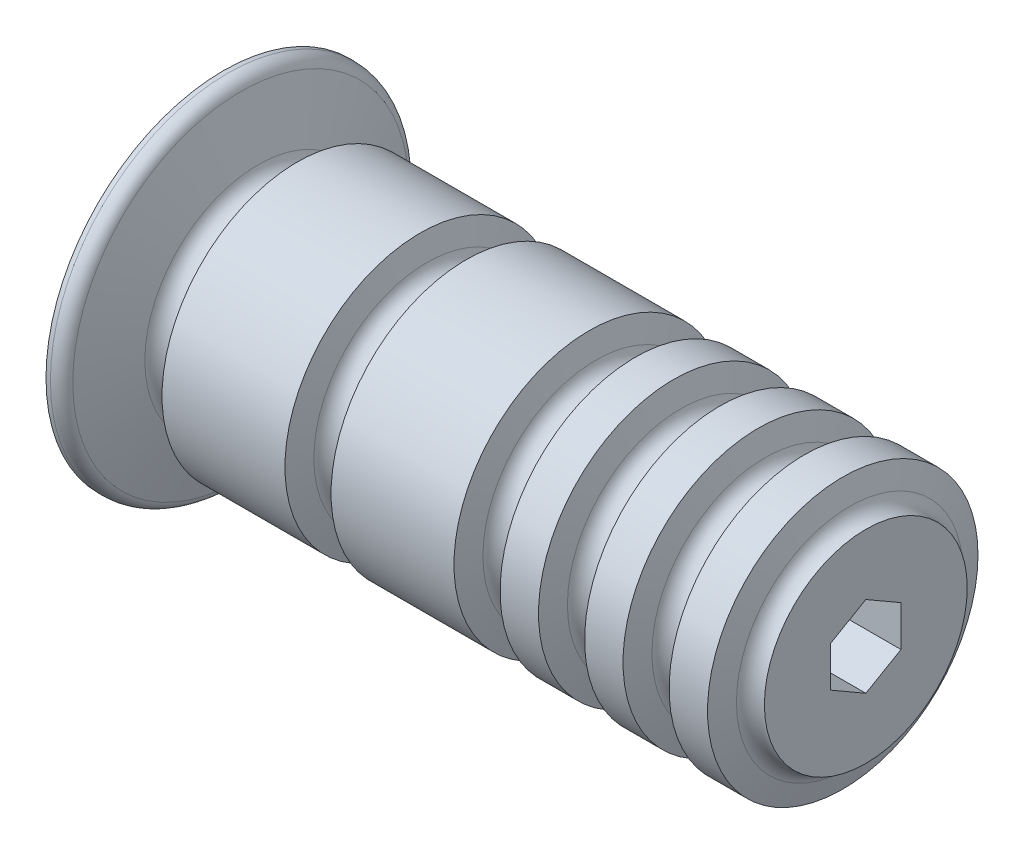
ISO-10303-21;
HEADER;
FILE_DESCRIPTION(('STEP AP214'),'2;1');
FILE_NAME('part.step','',(''),(''),'','','');
FILE_SCHEMA(('AUTOMOTIVE_DESIGN { 1 0 10303 214 1 1 1 1 }'));
ENDSEC;
DATA;
#1=APPLICATION_CONTEXT('core data for automotive mechanical design processes');
#2=APPLICATION_PROTOCOL_DEFINITION('international standard','automotive_design',2000,#1);
#3=PRODUCT_CONTEXT('',#1,'mechanical');
#4=PRODUCT('Part','Part','',(#3));
#5=PRODUCT_RELATED_PRODUCT_CATEGORY('part','',(#4));
#6=PRODUCT_DEFINITION_FORMATION('','',#4);
#7=PRODUCT_DEFINITION_CONTEXT('part definition',#1,'design');
#8=PRODUCT_DEFINITION('design','',#6,#7);
#9=PRODUCT_DEFINITION_SHAPE('','',#8);
#10=(LENGTH_UNIT() NAMED_UNIT(*) SI_UNIT(.MILLI.,.METRE.));
#11=(NAMED_UNIT(*) PLANE_ANGLE_UNIT() SI_UNIT($,.RADIAN.));
#12=(NAMED_UNIT(*) SI_UNIT($,.STERADIAN.) SOLID_ANGLE_UNIT());
#13=UNCERTAINTY_MEASURE_WITH_UNIT(LENGTH_MEASURE(1.E-05),#10,'distance_accuracy_value','');
#14=(GEOMETRIC_REPRESENTATION_CONTEXT(3) GLOBAL_UNCERTAINTY_ASSIGNED_CONTEXT((#13)) GLOBAL_UNIT_ASSIGNED_CONTEXT((#10,
#11,#12)) REPRESENTATION_CONTEXT('',''));
#15=CARTESIAN_POINT('',(0.,0.,0.));
#16=DIRECTION('',(0.,0.,1.));
#17=DIRECTION('',(1.,0.,0.));
#18=AXIS2_PLACEMENT_3D('',#15,#16,#17);
#19=CARTESIAN_POINT('',(0.,0.,0.));
#20=DIRECTION('',(1.,0.,0.));
#21=DIRECTION('',(0.,0.,-1.));
#22=AXIS2_PLACEMENT_3D('',#19,#20,#21);
#23=CYLINDRICAL_SURFACE('',#22,25.4);
#24=CARTESIAN_POINT('',(84.5698463729872,0.,0.));
#25=DIRECTION('',(1.,0.,0.));
#26=DIRECTION('',(0.,0.,-1.));
#27=AXIS2_PLACEMENT_3D('',#24,#25,#26);
#28=CIRCLE('',#27,25.3999999999998);
#29=CARTESIAN_POINT('',(84.5698463729872,0.,-25.3999999999998));
#30=VERTEX_POINT('',#29);
#31=EDGE_CURVE('E112',#30,#30,#28,.T.);
#32=ORIENTED_EDGE('',*,*,#31,.F.);
#33=EDGE_LOOP('',(#32));
#34=FACE_BOUND('',#33,.T.);
#35=CARTESIAN_POINT('',(77.3551536270128,0.,0.));
#36=DIRECTION('',(1.,0.,0.));
#37=DIRECTION('',(0.,0.,-1.));
#38=AXIS2_PLACEMENT_3D('',#35,#36,#37);
#39=CIRCLE('',#38,25.4);
#40=CARTESIAN_POINT('',(77.3551536270128,0.,-25.4));
#41=VERTEX_POINT('',#40);
#42=EDGE_CURVE('E161',#41,#41,#39,.T.);
#43=ORIENTED_EDGE('',*,*,#42,.T.);
#44=EDGE_LOOP('',(#43));
#45=FACE_BOUND('',#44,.T.);
#46=ADVANCED_FACE('F32',(#34,#45),#23,.T.);
#47=CARTESIAN_POINT('',(120.65,25.4,0.));
#48=DIRECTION('',(1.,0.,0.));
#49=DIRECTION('',(0.,0.,-1.));
#50=AXIS2_PLACEMENT_3D('',#47,#48,#49);
#51=PLANE('',#50);
#52=DIRECTION('',(0.,0.5,-0.866025403784439));
#53=VECTOR('',#52,1.);
#54=CARTESIAN_POINT('',(120.65,3.81282117772829,6.604));
#55=LINE('',#54,#53);
#56=CARTESIAN_POINT('',(120.65,3.81282117772829,6.604));
#57=VERTEX_POINT('',#56);
#58=CARTESIAN_POINT('',(120.65,7.62564235545658,0.));
#59=VERTEX_POINT('',#58);
#60=EDGE_CURVE('E89',#57,#59,#55,.T.);
#61=ORIENTED_EDGE('',*,*,#60,.T.);
#62=DIRECTION('',(0.,-0.5,-0.866025403784439));
#63=VECTOR('',#62,1.);
#64=CARTESIAN_POINT('',(120.65,7.62564235545658,0.));
#65=LINE('',#64,#63);
#66=CARTESIAN_POINT('',(120.65,3.81282117772829,-6.604));
#67=VERTEX_POINT('',#66);
#68=EDGE_CURVE('E98',#59,#67,#65,.T.);
#69=ORIENTED_EDGE('',*,*,#68,.T.);
#70=DIRECTION('',(0.,-1.,0.));
#71=VECTOR('',#70,1.);
#72=CARTESIAN_POINT('',(120.65,3.81282117772829,-6.604));
#73=LINE('',#72,#71);
#74=CARTESIAN_POINT('',(120.65,-3.81282117772829,-6.604));
#75=VERTEX_POINT('',#74);
#76=EDGE_CURVE('E57',#67,#75,#73,.T.);
#77=ORIENTED_EDGE('',*,*,#76,.T.);
#78=DIRECTION('',(0.,-0.5,0.866025403784439));
#79=VECTOR('',#78,1.);
#80=CARTESIAN_POINT('',(120.65,-3.81282117772829,-6.604));
#81=LINE('',#80,#79);
#82=CARTESIAN_POINT('',(120.65,-7.62564235545658,0.));
#83=VERTEX_POINT('',#82);
#84=EDGE_CURVE('E116',#75,#83,#81,.T.);
#85=ORIENTED_EDGE('',*,*,#84,.T.);
#86=DIRECTION('',(0.,0.5,0.866025403784439));
#87=VECTOR('',#86,1.);
#88=CARTESIAN_POINT('',(120.65,-7.62564235545658,0.));
#89=LINE('',#88,#87);
#90=CARTESIAN_POINT('',(120.65,-3.81282117772829,6.604));
#91=VERTEX_POINT('',#90);
#92=EDGE_CURVE('E119',#83,#91,#89,.T.);
#93=ORIENTED_EDGE('',*,*,#92,.T.);
#94=DIRECTION('',(0.,1.,0.));
#95=VECTOR('',#94,1.);
#96=CARTESIAN_POINT('',(120.65,-3.81282117772829,6.604));
#97=LINE('',#96,#95);
#98=EDGE_CURVE('E95',#91,#57,#97,.T.);
#99=ORIENTED_EDGE('',*,*,#98,.T.);
#100=EDGE_LOOP('',(#61,#69,#77,#85,#93,#99));
#101=FACE_BOUND('',#100,.T.);
#102=CARTESIAN_POINT('',(120.65,0.,0.));
#103=DIRECTION('',(-1.,0.,0.));
#104=DIRECTION('',(0.,0.,1.));
#105=AXIS2_PLACEMENT_3D('',#102,#103,#104);
#106=CIRCLE('',#105,19.05);
#107=CARTESIAN_POINT('',(120.65,0.,19.05));
#108=VERTEX_POINT('',#107);
#109=EDGE_CURVE('E36',#108,#108,#106,.T.);
#110=ORIENTED_EDGE('',*,*,#109,.F.);
#111=EDGE_LOOP('',(#110));
#112=FACE_BOUND('',#111,.T.);
#113=ADVANCED_FACE('F102',(#101,#112),#51,.T.);
#114=CARTESIAN_POINT('',(0.,0.,0.));
#115=DIRECTION('',(-1.,0.,0.));
#116=DIRECTION('',(0.,0.,1.));
#117=AXIS2_PLACEMENT_3D('',#114,#115,#116);
#118=PLANE('',#117);
#119=DIRECTION('',(0.,0.5,-0.866025403784439));
#120=VECTOR('',#119,1.);
#121=CARTESIAN_POINT('',(0.,3.81282117772829,6.604));
#122=LINE('',#121,#120);
#123=CARTESIAN_POINT('',(0.,3.81282117772829,6.604));
#124=VERTEX_POINT('',#123);
#125=CARTESIAN_POINT('',(0.,7.62564235545658,0.));
#126=VERTEX_POINT('',#125);
#127=EDGE_CURVE('E49',#124,#126,#122,.T.);
#128=ORIENTED_EDGE('',*,*,#127,.F.);
#129=DIRECTION('',(0.,1.,0.));
#130=VECTOR('',#129,1.);
#131=CARTESIAN_POINT('',(0.,-3.81282117772829,6.604));
#132=LINE('',#131,#130);
#133=CARTESIAN_POINT('',(0.,-3.81282117772829,6.604));
#134=VERTEX_POINT('',#133);
#135=EDGE_CURVE('E106',#134,#124,#132,.T.);
#136=ORIENTED_EDGE('',*,*,#135,.F.);
#137=DIRECTION('',(0.,0.5,0.866025403784439));
#138=VECTOR('',#137,1.);
#139=CARTESIAN_POINT('',(0.,-7.62564235545658,0.));
#140=LINE('',#139,#138);
#141=CARTESIAN_POINT('',(0.,-7.62564235545658,0.));
#142=VERTEX_POINT('',#141);
#143=EDGE_CURVE('E109',#142,#134,#140,.T.);
#144=ORIENTED_EDGE('',*,*,#143,.F.);
#145=DIRECTION('',(0.,-0.5,0.866025403784439));
#146=VECTOR('',#145,1.);
#147=CARTESIAN_POINT('',(0.,-3.81282117772829,-6.604));
#148=LINE('',#147,#146);
#149=CARTESIAN_POINT('',(0.,-3.81282117772829,-6.604));
#150=VERTEX_POINT('',#149);
#151=EDGE_CURVE('E128',#150,#142,#148,.T.);
#152=ORIENTED_EDGE('',*,*,#151,.F.);
#153=DIRECTION('',(0.,-1.,0.));
#154=VECTOR('',#153,1.);
#155=CARTESIAN_POINT('',(0.,3.81282117772829,-6.604));
#156=LINE('',#155,#154);
#157=CARTESIAN_POINT('',(0.,3.81282117772829,-6.604));
#158=VERTEX_POINT('',#157);
#159=EDGE_CURVE('E125',#158,#150,#156,.T.);
#160=ORIENTED_EDGE('',*,*,#159,.F.);
#161=DIRECTION('',(0.,-0.5,-0.866025403784439));
#162=VECTOR('',#161,1.);
#163=CARTESIAN_POINT('',(0.,7.62564235545658,0.));
#164=LINE('',#163,#162);
#165=EDGE_CURVE('E123',#126,#158,#164,.T.);
#166=ORIENTED_EDGE('',*,*,#165,.F.);
#167=EDGE_LOOP('',(#128,#136,#144,#152,#160,#166));
#168=FACE_BOUND('',#167,.T.);
#169=CARTESIAN_POINT('',(0.,0.,0.));
#170=DIRECTION('',(1.,0.,0.));
#171=DIRECTION('',(0.,0.,-1.));
#172=AXIS2_PLACEMENT_3D('',#169,#170,#171);
#173=CIRCLE('',#172,33.3375);
#174=CARTESIAN_POINT('',(0.,0.,-33.3375));
#175=VERTEX_POINT('',#174);
#176=EDGE_CURVE('E255',#175,#175,#173,.T.);
#177=ORIENTED_EDGE('',*,*,#176,.F.);
#178=EDGE_LOOP('',(#177));
#179=FACE_BOUND('',#178,.T.);
#180=ADVANCED_FACE('F34',(#168,#179),#118,.T.);
#181=CARTESIAN_POINT('',(5.19484637298717,0.,0.));
#182=DIRECTION('',(-1.,0.,0.));
#183=DIRECTION('',(0.,0.,1.));
#184=AXIS2_PLACEMENT_3D('',#181,#182,#183);
#185=CONICAL_SURFACE('',#184,25.4,1.26536370769589);
#186=CARTESIAN_POINT('',(6.49694868137438,0.,0.));
#187=DIRECTION('',(1.,0.,0.));
#188=DIRECTION('',(0.,0.,-1.));
#189=AXIS2_PLACEMENT_3D('',#186,#187,#188);
#190=CIRCLE('',#189,21.2702590865739);
#191=CARTESIAN_POINT('',(6.49694868137438,0.,-21.2702590865739));
#192=VERTEX_POINT('',#191);
#193=EDGE_CURVE('E11',#192,#192,#190,.T.);
#194=ORIENTED_EDGE('',*,*,#193,.F.);
#195=EDGE_LOOP('',(#194));
#196=FACE_BOUND('',#195,.T.);
#197=CARTESIAN_POINT('',(3.25219823705571,0.,0.));
#198=DIRECTION('',(1.,0.,0.));
#199=DIRECTION('',(0.,0.,-1.));
#200=AXIS2_PLACEMENT_3D('',#197,#198,#199);
#201=CIRCLE('',#200,31.5612927307408);
#202=CARTESIAN_POINT('',(3.25219823705571,0.,-31.5612927307408));
#203=VERTEX_POINT('',#202);
#204=EDGE_CURVE('E250',#203,#203,#201,.T.);
#205=ORIENTED_EDGE('',*,*,#204,.T.);
#206=EDGE_LOOP('',(#205));
#207=FACE_BOUND('',#206,.T.);
#208=ADVANCED_FACE('F241',(#196,#207),#185,.T.);
#209=CARTESIAN_POINT('',(9.52500000000001,0.,0.));
#210=DIRECTION('',(1.,0.,0.));
#211=DIRECTION('',(0.,0.,-1.));
#212=AXIS2_PLACEMENT_3D('',#209,#210,#211);
#213=TOROIDAL_SURFACE('',#212,22.225,3.175);
#214=CARTESIAN_POINT('',(12.5530513186256,0.,0.));
#215=DIRECTION('',(1.,0.,0.));
#216=DIRECTION('',(0.,0.,-1.));
#217=AXIS2_PLACEMENT_3D('',#214,#215,#216);
#218=CIRCLE('',#217,21.2702590865739);
#219=CARTESIAN_POINT('',(12.5530513186256,0.,-21.2702590865739));
#220=VERTEX_POINT('',#219);
#221=EDGE_CURVE('E41',#220,#220,#218,.T.);
#222=ORIENTED_EDGE('',*,*,#221,.F.);
#223=EDGE_LOOP('',(#222));
#224=FACE_BOUND('',#223,.T.);
#225=ORIENTED_EDGE('',*,*,#193,.T.);
#226=EDGE_LOOP('',(#225));
#227=FACE_BOUND('',#226,.T.);
#228=ADVANCED_FACE('F229',(#224,#227),#213,.F.);
#229=CARTESIAN_POINT('',(12.5530513186256,0.,0.));
#230=DIRECTION('',(1.,0.,0.));
#231=DIRECTION('',(0.,0.,-1.));
#232=AXIS2_PLACEMENT_3D('',#229,#230,#231);
#233=CONICAL_SURFACE('',#232,21.2702590865739,1.26536370769589);
#234=CARTESIAN_POINT('',(13.8551536270128,0.,0.));
#235=DIRECTION('',(1.,0.,0.));
#236=DIRECTION('',(0.,0.,-1.));
#237=AXIS2_PLACEMENT_3D('',#234,#235,#236);
#238=CIRCLE('',#237,25.4);
#239=CARTESIAN_POINT('',(13.8551536270128,0.,-25.4));
#240=VERTEX_POINT('',#239);
#241=EDGE_CURVE('E143',#240,#240,#238,.T.);
#242=ORIENTED_EDGE('',*,*,#241,.F.);
#243=EDGE_LOOP('',(#242));
#244=FACE_BOUND('',#243,.T.);
#245=ORIENTED_EDGE('',*,*,#221,.T.);
#246=EDGE_LOOP('',(#245));
#247=FACE_BOUND('',#246,.T.);
#248=ADVANCED_FACE('F220',(#244,#247),#233,.T.);
#249=ORIENTED_EDGE('',*,*,#241,.T.);
#250=EDGE_LOOP('',(#249));
#251=FACE_BOUND('',#250,.T.);
#252=CARTESIAN_POINT('',(36.9448463729872,0.,0.));
#253=DIRECTION('',(1.,0.,0.));
#254=DIRECTION('',(0.,0.,-1.));
#255=AXIS2_PLACEMENT_3D('',#252,#253,#254);
#256=CIRCLE('',#255,25.4);
#257=CARTESIAN_POINT('',(36.9448463729872,0.,-25.4));
#258=VERTEX_POINT('',#257);
#259=EDGE_CURVE('E146',#258,#258,#256,.T.);
#260=ORIENTED_EDGE('',*,*,#259,.F.);
#261=EDGE_LOOP('',(#260));
#262=FACE_BOUND('',#261,.T.);
#263=ADVANCED_FACE('F210',(#251,#262),#23,.T.);
#264=CARTESIAN_POINT('',(36.9448463729872,0.,0.));
#265=DIRECTION('',(-1.,0.,0.));
#266=DIRECTION('',(0.,0.,1.));
#267=AXIS2_PLACEMENT_3D('',#264,#265,#266);
#268=CONICAL_SURFACE('',#267,25.4,1.26536370769589);
#269=CARTESIAN_POINT('',(38.2469486813744,0.,0.));
#270=DIRECTION('',(1.,0.,0.));
#271=DIRECTION('',(0.,0.,-1.));
#272=AXIS2_PLACEMENT_3D('',#269,#270,#271);
#273=CIRCLE('',#272,21.2702590865739);
#274=CARTESIAN_POINT('',(38.2469486813744,0.,-21.2702590865739));
#275=VERTEX_POINT('',#274);
#276=EDGE_CURVE('E156',#275,#275,#273,.T.);
#277=ORIENTED_EDGE('',*,*,#276,.F.);
#278=EDGE_LOOP('',(#277));
#279=FACE_BOUND('',#278,.T.);
#280=ORIENTED_EDGE('',*,*,#259,.T.);
#281=EDGE_LOOP('',(#280));
#282=FACE_BOUND('',#281,.T.);
#283=ADVANCED_FACE('F219',(#279,#282),#268,.T.);
#284=CARTESIAN_POINT('',(41.275,0.,0.));
#285=DIRECTION('',(1.,0.,0.));
#286=DIRECTION('',(0.,0.,-1.));
#287=AXIS2_PLACEMENT_3D('',#284,#285,#286);
#288=TOROIDAL_SURFACE('',#287,22.225,3.175);
#289=CARTESIAN_POINT('',(44.3030513186256,0.,0.));
#290=DIRECTION('',(1.,0.,0.));
#291=DIRECTION('',(0.,0.,-1.));
#292=AXIS2_PLACEMENT_3D('',#289,#290,#291);
#293=CIRCLE('',#292,21.2702590865739);
#294=CARTESIAN_POINT('',(44.3030513186256,0.,-21.2702590865739));
#295=VERTEX_POINT('',#294);
#296=EDGE_CURVE('E152',#295,#295,#293,.T.);
#297=ORIENTED_EDGE('',*,*,#296,.F.);
#298=EDGE_LOOP('',(#297));
#299=FACE_BOUND('',#298,.T.);
#300=ORIENTED_EDGE('',*,*,#276,.T.);
#301=EDGE_LOOP('',(#300));
#302=FACE_BOUND('',#301,.T.);
#303=ADVANCED_FACE('F226',(#299,#302),#288,.F.);
#304=CARTESIAN_POINT('',(44.3030513186256,0.,0.));
#305=DIRECTION('',(1.,0.,0.));
#306=DIRECTION('',(0.,0.,-1.));
#307=AXIS2_PLACEMENT_3D('',#304,#305,#306);
#308=CONICAL_SURFACE('',#307,21.2702590865739,1.26536370769589);
#309=CARTESIAN_POINT('',(45.6051536270128,0.,0.));
#310=DIRECTION('',(1.,0.,0.));
#311=DIRECTION('',(0.,0.,-1.));
#312=AXIS2_PLACEMENT_3D('',#309,#310,#311);
#313=CIRCLE('',#312,25.4);
#314=CARTESIAN_POINT('',(45.6051536270128,0.,-25.4));
#315=VERTEX_POINT('',#314);
#316=EDGE_CURVE('E149',#315,#315,#313,.T.);
#317=ORIENTED_EDGE('',*,*,#316,.F.);
#318=EDGE_LOOP('',(#317));
#319=FACE_BOUND('',#318,.T.);
#320=ORIENTED_EDGE('',*,*,#296,.T.);
#321=EDGE_LOOP('',(#320));
#322=FACE_BOUND('',#321,.T.);
#323=ADVANCED_FACE('F208',(#319,#322),#308,.T.);
#324=ORIENTED_EDGE('',*,*,#316,.T.);
#325=EDGE_LOOP('',(#324));
#326=FACE_BOUND('',#325,.T.);
#327=CARTESIAN_POINT('',(68.6948463729872,0.,0.));
#328=DIRECTION('',(1.,0.,0.));
#329=DIRECTION('',(0.,0.,-1.));
#330=AXIS2_PLACEMENT_3D('',#327,#328,#329);
#331=CIRCLE('',#330,25.4);
#332=CARTESIAN_POINT('',(68.6948463729872,0.,-25.4));
#333=VERTEX_POINT('',#332);
#334=EDGE_CURVE('E153',#333,#333,#331,.T.);
#335=ORIENTED_EDGE('',*,*,#334,.F.);
#336=EDGE_LOOP('',(#335));
#337=FACE_BOUND('',#336,.T.);
#338=ADVANCED_FACE('F190',(#326,#337),#23,.T.);
#339=CARTESIAN_POINT('',(68.6948463729872,0.,0.));
#340=DIRECTION('',(-1.,0.,0.));
#341=DIRECTION('',(0.,0.,1.));
#342=AXIS2_PLACEMENT_3D('',#339,#340,#341);
#343=CONICAL_SURFACE('',#342,25.4,1.26536370769589);
#344=CARTESIAN_POINT('',(69.9969486813744,0.,0.));
#345=DIRECTION('',(1.,0.,0.));
#346=DIRECTION('',(0.,0.,-1.));
#347=AXIS2_PLACEMENT_3D('',#344,#345,#346);
#348=CIRCLE('',#347,21.2702590865739);
#349=CARTESIAN_POINT('',(69.9969486813744,0.,-21.2702590865739));
#350=VERTEX_POINT('',#349);
#351=EDGE_CURVE('E168',#350,#350,#348,.T.);
#352=ORIENTED_EDGE('',*,*,#351,.F.);
#353=EDGE_LOOP('',(#352));
#354=FACE_BOUND('',#353,.T.);
#355=ORIENTED_EDGE('',*,*,#334,.T.);
#356=EDGE_LOOP('',(#355));
#357=FACE_BOUND('',#356,.T.);
#358=ADVANCED_FACE('F207',(#354,#357),#343,.T.);
#359=CARTESIAN_POINT('',(73.025,0.,0.));
#360=DIRECTION('',(1.,0.,0.));
#361=DIRECTION('',(0.,0.,-1.));
#362=AXIS2_PLACEMENT_3D('',#359,#360,#361);
#363=TOROIDAL_SURFACE('',#362,22.225,3.17500000000001);
#364=CARTESIAN_POINT('',(76.0530513186256,0.,0.));
#365=DIRECTION('',(1.,0.,0.));
#366=DIRECTION('',(0.,0.,-1.));
#367=AXIS2_PLACEMENT_3D('',#364,#365,#366);
#368=CIRCLE('',#367,21.2702590865739);
#369=CARTESIAN_POINT('',(76.0530513186256,0.,-21.2702590865739));
#370=VERTEX_POINT('',#369);
#371=EDGE_CURVE('E164',#370,#370,#368,.T.);
#372=ORIENTED_EDGE('',*,*,#371,.F.);
#373=EDGE_LOOP('',(#372));
#374=FACE_BOUND('',#373,.T.);
#375=ORIENTED_EDGE('',*,*,#351,.T.);
#376=EDGE_LOOP('',(#375));
#377=FACE_BOUND('',#376,.T.);
#378=ADVANCED_FACE('F321',(#374,#377),#363,.F.);
#379=CARTESIAN_POINT('',(76.0530513186256,0.,0.));
#380=DIRECTION('',(1.,0.,0.));
#381=DIRECTION('',(0.,0.,-1.));
#382=AXIS2_PLACEMENT_3D('',#379,#380,#381);
#383=CONICAL_SURFACE('',#382,21.2702590865739,1.26536370769589);
#384=ORIENTED_EDGE('',*,*,#42,.F.);
#385=EDGE_LOOP('',(#384));
#386=FACE_BOUND('',#385,.T.);
#387=ORIENTED_EDGE('',*,*,#371,.T.);
#388=EDGE_LOOP('',(#387));
#389=FACE_BOUND('',#388,.T.);
#390=ADVANCED_FACE('F311',(#386,#389),#383,.T.);
#391=CARTESIAN_POINT('',(120.65,3.81282117772829,6.604));
#392=DIRECTION('',(0.,0.866025403784439,0.5));
#393=DIRECTION('',(0.,-0.5,0.866025403784439));
#394=AXIS2_PLACEMENT_3D('',#391,#392,#393);
#395=PLANE('',#394);
#396=ORIENTED_EDGE('',*,*,#127,.T.);
#397=DIRECTION('',(-1.,0.,0.));
#398=VECTOR('',#397,1.);
#399=CARTESIAN_POINT('',(120.65,7.62564235545658,0.));
#400=LINE('',#399,#398);
#401=EDGE_CURVE('E85',#59,#126,#400,.T.);
#402=ORIENTED_EDGE('',*,*,#401,.F.);
#403=ORIENTED_EDGE('',*,*,#60,.F.);
#404=DIRECTION('',(-1.,0.,0.));
#405=VECTOR('',#404,1.);
#406=CARTESIAN_POINT('',(120.65,3.81282117772829,6.604));
#407=LINE('',#406,#405);
#408=EDGE_CURVE('E133',#57,#124,#407,.T.);
#409=ORIENTED_EDGE('',*,*,#408,.T.);
#410=EDGE_LOOP('',(#396,#402,#403,#409));
#411=FACE_BOUND('',#410,.T.);
#412=ADVANCED_FACE('F87',(#411),#395,.F.);
#413=CARTESIAN_POINT('',(120.65,-3.81282117772829,6.604));
#414=DIRECTION('',(0.,0.,1.));
#415=DIRECTION('',(0.,-1.,0.));
#416=AXIS2_PLACEMENT_3D('',#413,#414,#415);
#417=PLANE('',#416);
#418=ORIENTED_EDGE('',*,*,#135,.T.);
#419=ORIENTED_EDGE('',*,*,#408,.F.);
#420=ORIENTED_EDGE('',*,*,#98,.F.);
#421=DIRECTION('',(-1.,0.,0.));
#422=VECTOR('',#421,1.);
#423=CARTESIAN_POINT('',(120.65,-3.81282117772829,6.604));
#424=LINE('',#423,#422);
#425=EDGE_CURVE('E136',#91,#134,#424,.T.);
#426=ORIENTED_EDGE('',*,*,#425,.T.);
#427=EDGE_LOOP('',(#418,#419,#420,#426));
#428=FACE_BOUND('',#427,.T.);
#429=ADVANCED_FACE('F293',(#428),#417,.F.);
#430=CARTESIAN_POINT('',(120.65,-7.62564235545658,0.));
#431=DIRECTION('',(0.,-0.866025403784439,0.5));
#432=DIRECTION('',(0.,-0.5,-0.866025403784439));
#433=AXIS2_PLACEMENT_3D('',#430,#431,#432);
#434=PLANE('',#433);
#435=ORIENTED_EDGE('',*,*,#143,.T.);
#436=ORIENTED_EDGE('',*,*,#425,.F.);
#437=ORIENTED_EDGE('',*,*,#92,.F.);
#438=DIRECTION('',(-1.,0.,0.));
#439=VECTOR('',#438,1.);
#440=CARTESIAN_POINT('',(120.65,-7.62564235545658,0.));
#441=LINE('',#440,#439);
#442=EDGE_CURVE('E138',#83,#142,#441,.T.);
#443=ORIENTED_EDGE('',*,*,#442,.T.);
#444=EDGE_LOOP('',(#435,#436,#437,#443));
#445=FACE_BOUND('',#444,.T.);
#446=ADVANCED_FACE('F296',(#445),#434,.F.);
#447=CARTESIAN_POINT('',(120.65,-3.81282117772829,-6.604));
#448=DIRECTION('',(0.,-0.866025403784439,-0.5));
#449=DIRECTION('',(0.,0.5,-0.866025403784439));
#450=AXIS2_PLACEMENT_3D('',#447,#448,#449);
#451=PLANE('',#450);
#452=ORIENTED_EDGE('',*,*,#151,.T.);
#453=ORIENTED_EDGE('',*,*,#442,.F.);
#454=ORIENTED_EDGE('',*,*,#84,.F.);
#455=DIRECTION('',(-1.,0.,0.));
#456=VECTOR('',#455,1.);
#457=CARTESIAN_POINT('',(120.65,-3.81282117772829,-6.604));
#458=LINE('',#457,#456);
#459=EDGE_CURVE('E140',#75,#150,#458,.T.);
#460=ORIENTED_EDGE('',*,*,#459,.T.);
#461=EDGE_LOOP('',(#452,#453,#454,#460));
#462=FACE_BOUND('',#461,.T.);
#463=ADVANCED_FACE('F300',(#462),#451,.F.);
#464=CARTESIAN_POINT('',(120.65,3.81282117772829,-6.604));
#465=DIRECTION('',(0.,0.,-1.));
#466=DIRECTION('',(-1.,0.,0.));
#467=AXIS2_PLACEMENT_3D('',#464,#465,#466);
#468=PLANE('',#467);
#469=ORIENTED_EDGE('',*,*,#159,.T.);
#470=ORIENTED_EDGE('',*,*,#459,.F.);
#471=ORIENTED_EDGE('',*,*,#76,.F.);
#472=DIRECTION('',(-1.,0.,0.));
#473=VECTOR('',#472,1.);
#474=CARTESIAN_POINT('',(120.65,3.81282117772829,-6.604));
#475=LINE('',#474,#473);
#476=EDGE_CURVE('E94',#67,#158,#475,.T.);
#477=ORIENTED_EDGE('',*,*,#476,.T.);
#478=EDGE_LOOP('',(#469,#470,#471,#477));
#479=FACE_BOUND('',#478,.T.);
#480=ADVANCED_FACE('F304',(#479),#468,.F.);
#481=CARTESIAN_POINT('',(120.65,7.62564235545658,0.));
#482=DIRECTION('',(0.,0.866025403784439,-0.5));
#483=DIRECTION('',(0.,0.5,0.866025403784439));
#484=AXIS2_PLACEMENT_3D('',#481,#482,#483);
#485=PLANE('',#484);
#486=ORIENTED_EDGE('',*,*,#165,.T.);
#487=ORIENTED_EDGE('',*,*,#476,.F.);
#488=ORIENTED_EDGE('',*,*,#68,.F.);
#489=ORIENTED_EDGE('',*,*,#401,.T.);
#490=EDGE_LOOP('',(#486,#487,#488,#489));
#491=FACE_BOUND('',#490,.T.);
#492=ADVANCED_FACE('F99',(#491),#485,.F.);
#493=CARTESIAN_POINT('',(116.319846372987,0.,0.));
#494=DIRECTION('',(-1.,0.,0.));
#495=DIRECTION('',(0.,0.,1.));
#496=AXIS2_PLACEMENT_3D('',#493,#494,#495);
#497=CONICAL_SURFACE('',#496,25.4,1.26536370769589);
#498=CARTESIAN_POINT('',(117.621948681374,0.,0.));
#499=DIRECTION('',(1.,0.,0.));
#500=DIRECTION('',(0.,0.,-1.));
#501=AXIS2_PLACEMENT_3D('',#498,#499,#500);
#502=CIRCLE('',#501,21.2702590865739);
#503=CARTESIAN_POINT('',(117.621948681374,0.,-21.2702590865739));
#504=VERTEX_POINT('',#503);
#505=EDGE_CURVE('E261',#504,#504,#502,.T.);
#506=ORIENTED_EDGE('',*,*,#505,.F.);
#507=EDGE_LOOP('',(#506));
#508=FACE_BOUND('',#507,.T.);
#509=CARTESIAN_POINT('',(116.319846372987,0.,0.));
#510=DIRECTION('',(1.,0.,0.));
#511=DIRECTION('',(0.,0.,-1.));
#512=AXIS2_PLACEMENT_3D('',#509,#510,#511);
#513=CIRCLE('',#512,25.4);
#514=CARTESIAN_POINT('',(116.319846372987,0.,-25.4));
#515=VERTEX_POINT('',#514);
#516=EDGE_CURVE('E264',#515,#515,#513,.T.);
#517=ORIENTED_EDGE('',*,*,#516,.T.);
#518=EDGE_LOOP('',(#517));
#519=FACE_BOUND('',#518,.T.);
#520=ADVANCED_FACE('F288',(#508,#519),#497,.T.);
#521=CARTESIAN_POINT('',(120.65,0.,0.));
#522=DIRECTION('',(1.,0.,0.));
#523=DIRECTION('',(0.,0.,-1.));
#524=AXIS2_PLACEMENT_3D('',#521,#522,#523);
#525=TOROIDAL_SURFACE('',#524,22.225,3.17500000000001);
#526=ORIENTED_EDGE('',*,*,#109,.T.);
#527=EDGE_LOOP('',(#526));
#528=FACE_BOUND('',#527,.T.);
#529=ORIENTED_EDGE('',*,*,#505,.T.);
#530=EDGE_LOOP('',(#529));
#531=FACE_BOUND('',#530,.T.);
#532=ADVANCED_FACE('F279',(#528,#531),#525,.F.);
#533=CARTESIAN_POINT('',(84.5698463729872,0.,0.));
#534=DIRECTION('',(-1.,0.,0.));
#535=DIRECTION('',(0.,0.,1.));
#536=AXIS2_PLACEMENT_3D('',#533,#534,#535);
#537=CONICAL_SURFACE('',#536,25.3999999999998,1.26536370769589);
#538=CARTESIAN_POINT('',(85.8719486813744,0.,0.));
#539=DIRECTION('',(1.,0.,0.));
#540=DIRECTION('',(0.,0.,-1.));
#541=AXIS2_PLACEMENT_3D('',#538,#539,#540);
#542=CIRCLE('',#541,21.2702590865737);
#543=CARTESIAN_POINT('',(85.8719486813744,0.,-21.2702590865737));
#544=VERTEX_POINT('',#543);
#545=EDGE_CURVE('E270',#544,#544,#542,.T.);
#546=ORIENTED_EDGE('',*,*,#545,.F.);
#547=EDGE_LOOP('',(#546));
#548=FACE_BOUND('',#547,.T.);
#549=ORIENTED_EDGE('',*,*,#31,.T.);
#550=EDGE_LOOP('',(#549));
#551=FACE_BOUND('',#550,.T.);
#552=ADVANCED_FACE('F276',(#548,#551),#537,.T.);
#553=CARTESIAN_POINT('',(88.9,0.,0.));
#554=DIRECTION('',(1.,0.,0.));
#555=DIRECTION('',(0.,0.,-1.));
#556=AXIS2_PLACEMENT_3D('',#553,#554,#555);
#557=TOROIDAL_SURFACE('',#556,22.2249999999998,3.17500000000001);
#558=CARTESIAN_POINT('',(91.9280513186256,0.,0.));
#559=DIRECTION('',(1.,0.,0.));
#560=DIRECTION('',(0.,0.,-1.));
#561=AXIS2_PLACEMENT_3D('',#558,#559,#560);
#562=CIRCLE('',#561,21.2702590865737);
#563=CARTESIAN_POINT('',(91.9280513186256,0.,-21.2702590865737));
#564=VERTEX_POINT('',#563);
#565=EDGE_CURVE('E268',#564,#564,#562,.T.);
#566=ORIENTED_EDGE('',*,*,#565,.F.);
#567=EDGE_LOOP('',(#566));
#568=FACE_BOUND('',#567,.T.);
#569=ORIENTED_EDGE('',*,*,#545,.T.);
#570=EDGE_LOOP('',(#569));
#571=FACE_BOUND('',#570,.T.);
#572=ADVANCED_FACE('F278',(#568,#571),#557,.F.);
#573=CARTESIAN_POINT('',(91.9280513186256,0.,0.));
#574=DIRECTION('',(1.,0.,0.));
#575=DIRECTION('',(0.,0.,-1.));
#576=AXIS2_PLACEMENT_3D('',#573,#574,#575);
#577=CONICAL_SURFACE('',#576,21.2702590865737,1.26536370769589);
#578=CARTESIAN_POINT('',(93.2301536270128,0.,0.));
#579=DIRECTION('',(1.,0.,0.));
#580=DIRECTION('',(0.,0.,-1.));
#581=AXIS2_PLACEMENT_3D('',#578,#579,#580);
#582=CIRCLE('',#581,25.3999999999998);
#583=CARTESIAN_POINT('',(93.2301536270128,0.,-25.3999999999998));
#584=VERTEX_POINT('',#583);
#585=EDGE_CURVE('E260',#584,#584,#582,.T.);
#586=ORIENTED_EDGE('',*,*,#585,.F.);
#587=EDGE_LOOP('',(#586));
#588=FACE_BOUND('',#587,.T.);
#589=ORIENTED_EDGE('',*,*,#565,.T.);
#590=EDGE_LOOP('',(#589));
#591=FACE_BOUND('',#590,.T.);
#592=ADVANCED_FACE('F198',(#588,#591),#577,.T.);
#593=CARTESIAN_POINT('',(100.444846372987,0.,0.));
#594=DIRECTION('',(-1.,0.,0.));
#595=DIRECTION('',(0.,0.,1.));
#596=AXIS2_PLACEMENT_3D('',#593,#594,#595);
#597=CONICAL_SURFACE('',#596,25.4,1.26536370769589);
#598=CARTESIAN_POINT('',(101.746948681374,0.,0.));
#599=DIRECTION('',(1.,0.,0.));
#600=DIRECTION('',(0.,0.,-1.));
#601=AXIS2_PLACEMENT_3D('',#598,#599,#600);
#602=CIRCLE('',#601,21.2702590865739);
#603=CARTESIAN_POINT('',(101.746948681374,0.,-21.2702590865739));
#604=VERTEX_POINT('',#603);
#605=EDGE_CURVE('E178',#604,#604,#602,.T.);
#606=ORIENTED_EDGE('',*,*,#605,.F.);
#607=EDGE_LOOP('',(#606));
#608=FACE_BOUND('',#607,.T.);
#609=CARTESIAN_POINT('',(100.444846372987,0.,0.));
#610=DIRECTION('',(1.,0.,0.));
#611=DIRECTION('',(0.,0.,-1.));
#612=AXIS2_PLACEMENT_3D('',#609,#610,#611);
#613=CIRCLE('',#612,25.4);
#614=CARTESIAN_POINT('',(100.444846372987,0.,-25.4));
#615=VERTEX_POINT('',#614);
#616=EDGE_CURVE('E165',#615,#615,#613,.T.);
#617=ORIENTED_EDGE('',*,*,#616,.T.);
#618=EDGE_LOOP('',(#617));
#619=FACE_BOUND('',#618,.T.);
#620=ADVANCED_FACE('F183',(#608,#619),#597,.T.);
#621=ORIENTED_EDGE('',*,*,#585,.T.);
#622=EDGE_LOOP('',(#621));
#623=FACE_BOUND('',#622,.T.);
#624=ORIENTED_EDGE('',*,*,#616,.F.);
#625=EDGE_LOOP('',(#624));
#626=FACE_BOUND('',#625,.T.);
#627=ADVANCED_FACE('F185',(#623,#626),#23,.T.);
#628=CARTESIAN_POINT('',(104.775,0.,0.));
#629=DIRECTION('',(1.,0.,0.));
#630=DIRECTION('',(0.,0.,-1.));
#631=AXIS2_PLACEMENT_3D('',#628,#629,#630);
#632=TOROIDAL_SURFACE('',#631,22.225,3.17500000000001);
#633=CARTESIAN_POINT('',(107.803051318626,0.,0.));
#634=DIRECTION('',(1.,0.,0.));
#635=DIRECTION('',(0.,0.,-1.));
#636=AXIS2_PLACEMENT_3D('',#633,#634,#635);
#637=CIRCLE('',#636,21.2702590865739);
#638=CARTESIAN_POINT('',(107.803051318626,0.,-21.2702590865739));
#639=VERTEX_POINT('',#638);
#640=EDGE_CURVE('E175',#639,#639,#637,.T.);
#641=ORIENTED_EDGE('',*,*,#640,.F.);
#642=EDGE_LOOP('',(#641));
#643=FACE_BOUND('',#642,.T.);
#644=ORIENTED_EDGE('',*,*,#605,.T.);
#645=EDGE_LOOP('',(#644));
#646=FACE_BOUND('',#645,.T.);
#647=ADVANCED_FACE('F187',(#643,#646),#632,.F.);
#648=CARTESIAN_POINT('',(107.803051318626,0.,0.));
#649=DIRECTION('',(1.,0.,0.));
#650=DIRECTION('',(0.,0.,-1.));
#651=AXIS2_PLACEMENT_3D('',#648,#649,#650);
#652=CONICAL_SURFACE('',#651,21.2702590865739,1.26536370769589);
#653=CARTESIAN_POINT('',(109.105153627013,0.,0.));
#654=DIRECTION('',(1.,0.,0.));
#655=DIRECTION('',(0.,0.,-1.));
#656=AXIS2_PLACEMENT_3D('',#653,#654,#655);
#657=CIRCLE('',#656,25.4);
#658=CARTESIAN_POINT('',(109.105153627013,0.,-25.4));
#659=VERTEX_POINT('',#658);
#660=EDGE_CURVE('E135',#659,#659,#657,.T.);
#661=ORIENTED_EDGE('',*,*,#660,.F.);
#662=EDGE_LOOP('',(#661));
#663=FACE_BOUND('',#662,.T.);
#664=ORIENTED_EDGE('',*,*,#640,.T.);
#665=EDGE_LOOP('',(#664));
#666=FACE_BOUND('',#665,.T.);
#667=ADVANCED_FACE('F195',(#663,#666),#652,.T.);
#668=ORIENTED_EDGE('',*,*,#516,.F.);
#669=EDGE_LOOP('',(#668));
#670=FACE_BOUND('',#669,.T.);
#671=ORIENTED_EDGE('',*,*,#660,.T.);
#672=EDGE_LOOP('',(#671));
#673=FACE_BOUND('',#672,.T.);
#674=ADVANCED_FACE('F189',(#670,#673),#23,.T.);
#675=CARTESIAN_POINT('',(0.,0.,0.));
#676=DIRECTION('',(1.,0.,0.));
#677=DIRECTION('',(0.,0.,-1.));
#678=AXIS2_PLACEMENT_3D('',#675,#676,#677);
#679=CYLINDRICAL_SURFACE('',#678,33.3375);
#680=ORIENTED_EDGE('',*,*,#176,.T.);
#681=EDGE_LOOP('',(#680));
#682=FACE_BOUND('',#681,.T.);
#683=CARTESIAN_POINT('',(0.829757182155197,0.,0.));
#684=DIRECTION('',(1.,0.,0.));
#685=DIRECTION('',(0.,0.,-1.));
#686=AXIS2_PLACEMENT_3D('',#683,#684,#685);
#687=CIRCLE('',#686,33.3375);
#688=CARTESIAN_POINT('',(0.829757182155197,0.,-33.3375));
#689=VERTEX_POINT('',#688);
#690=EDGE_CURVE('E252',#689,#689,#687,.T.);
#691=ORIENTED_EDGE('',*,*,#690,.F.);
#692=EDGE_LOOP('',(#691));
#693=FACE_BOUND('',#692,.T.);
#694=ADVANCED_FACE('F204',(#682,#693),#679,.T.);
#695=CARTESIAN_POINT('',(0.829757182155211,0.,0.));
#696=DIRECTION('',(1.,0.,0.));
#697=DIRECTION('',(0.,0.,-1.));
#698=AXIS2_PLACEMENT_3D('',#695,#696,#697);
#699=TOROIDAL_SURFACE('',#698,30.7975,2.54);
#700=ORIENTED_EDGE('',*,*,#690,.T.);
#701=EDGE_LOOP('',(#700));
#702=FACE_BOUND('',#701,.T.);
#703=ORIENTED_EDGE('',*,*,#204,.F.);
#704=EDGE_LOOP('',(#703));
#705=FACE_BOUND('',#704,.T.);
#706=ADVANCED_FACE('F353',(#702,#705),#699,.T.);
#707=CLOSED_SHELL('',(#46,#113,#180,#208,#228,#248,#263,#283,#303,#323,#338,#358,#378,#390,#412,
#429,#446,#463,#480,#492,#520,#532,#552,#572,#592,#620,#627,#647,#667,#674,#694,#706));
#708=MANIFOLD_SOLID_BREP('B2',#707);
#709=ADVANCED_BREP_SHAPE_REPRESENTATION('',(#18,#708),#14);
#710=SHAPE_DEFINITION_REPRESENTATION(#9,#709);
ENDSEC;
END-ISO-10303-21;
